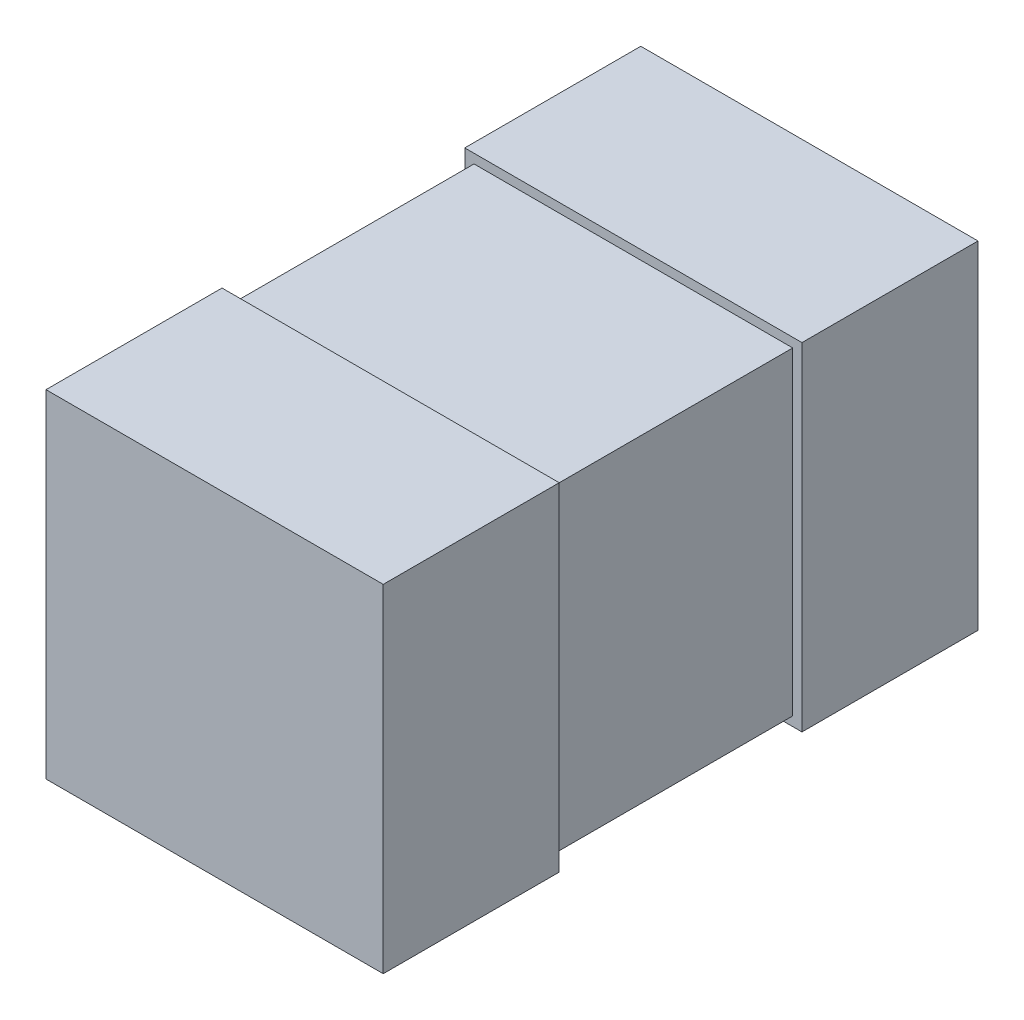
ISO-10303-21;
HEADER;
FILE_DESCRIPTION(('STEP AP214'),'2;1');
FILE_NAME('part.step','',(''),(''),'','','');
FILE_SCHEMA(('AUTOMOTIVE_DESIGN { 1 0 10303 214 1 1 1 1 }'));
ENDSEC;
DATA;
#1=APPLICATION_CONTEXT('core data for automotive mechanical design processes');
#2=APPLICATION_PROTOCOL_DEFINITION('international standard','automotive_design',2000,#1);
#3=PRODUCT_CONTEXT('',#1,'mechanical');
#4=PRODUCT('Part','Part','',(#3));
#5=PRODUCT_RELATED_PRODUCT_CATEGORY('part','',(#4));
#6=PRODUCT_DEFINITION_FORMATION('','',#4);
#7=PRODUCT_DEFINITION_CONTEXT('part definition',#1,'design');
#8=PRODUCT_DEFINITION('design','',#6,#7);
#9=PRODUCT_DEFINITION_SHAPE('','',#8);
#10=(LENGTH_UNIT() NAMED_UNIT(*) SI_UNIT(.MILLI.,.METRE.));
#11=(NAMED_UNIT(*) PLANE_ANGLE_UNIT() SI_UNIT($,.RADIAN.));
#12=(NAMED_UNIT(*) SI_UNIT($,.STERADIAN.) SOLID_ANGLE_UNIT());
#13=UNCERTAINTY_MEASURE_WITH_UNIT(LENGTH_MEASURE(1.E-05),#10,'distance_accuracy_value','');
#14=(GEOMETRIC_REPRESENTATION_CONTEXT(3) GLOBAL_UNCERTAINTY_ASSIGNED_CONTEXT((#13)) GLOBAL_UNIT_ASSIGNED_CONTEXT((#10,
#11,#12)) REPRESENTATION_CONTEXT('',''));
#15=CARTESIAN_POINT('',(0.,0.,0.));
#16=DIRECTION('',(0.,0.,1.));
#17=DIRECTION('',(1.,0.,0.));
#18=AXIS2_PLACEMENT_3D('',#15,#16,#17);
#19=CARTESIAN_POINT('',(-0.91,1.82,-1.605));
#20=DIRECTION('',(1.,0.,0.));
#21=DIRECTION('',(0.,1.,0.));
#22=AXIS2_PLACEMENT_3D('',#19,#20,#21);
#23=PLANE('',#22);
#24=DIRECTION('',(0.,1.,0.));
#25=VECTOR('',#24,1.);
#26=CARTESIAN_POINT('',(-0.91,1.82,-0.654999999999999));
#27=LINE('',#26,#25);
#28=CARTESIAN_POINT('',(-0.91,0.,-0.654999999999999));
#29=VERTEX_POINT('',#28);
#30=CARTESIAN_POINT('',(-0.91,1.82,-0.654999999999999));
#31=VERTEX_POINT('',#30);
#32=EDGE_CURVE('E106',#29,#31,#27,.T.);
#33=ORIENTED_EDGE('',*,*,#32,.T.);
#34=DIRECTION('',(0.,0.,1.));
#35=VECTOR('',#34,1.);
#36=CARTESIAN_POINT('',(-0.91,1.82,-1.605));
#37=LINE('',#36,#35);
#38=CARTESIAN_POINT('',(-0.91,1.82,-1.605));
#39=VERTEX_POINT('',#38);
#40=EDGE_CURVE('E12',#39,#31,#37,.T.);
#41=ORIENTED_EDGE('',*,*,#40,.F.);
#42=DIRECTION('',(0.,1.,0.));
#43=VECTOR('',#42,1.);
#44=CARTESIAN_POINT('',(-0.91,1.82,-1.605));
#45=LINE('',#44,#43);
#46=CARTESIAN_POINT('',(-0.91,0.,-1.605));
#47=VERTEX_POINT('',#46);
#48=EDGE_CURVE('E94',#47,#39,#45,.T.);
#49=ORIENTED_EDGE('',*,*,#48,.F.);
#50=DIRECTION('',(0.,0.,1.));
#51=VECTOR('',#50,1.);
#52=CARTESIAN_POINT('',(-0.91,0.,-1.605));
#53=LINE('',#52,#51);
#54=EDGE_CURVE('E102',#47,#29,#53,.T.);
#55=ORIENTED_EDGE('',*,*,#54,.T.);
#56=EDGE_LOOP('',(#33,#41,#49,#55));
#57=FACE_BOUND('',#56,.T.);
#58=ADVANCED_FACE('F43',(#57),#23,.F.);
#59=CARTESIAN_POINT('',(-0.91,1.82,-1.605));
#60=DIRECTION('',(0.,-1.,0.));
#61=DIRECTION('',(1.,0.,0.));
#62=AXIS2_PLACEMENT_3D('',#59,#60,#61);
#63=PLANE('',#62);
#64=DIRECTION('',(1.,0.,0.));
#65=VECTOR('',#64,1.);
#66=CARTESIAN_POINT('',(-0.91,1.82,-0.654999999999999));
#67=LINE('',#66,#65);
#68=CARTESIAN_POINT('',(0.91,1.82,-0.654999999999999));
#69=VERTEX_POINT('',#68);
#70=EDGE_CURVE('E98',#31,#69,#67,.T.);
#71=ORIENTED_EDGE('',*,*,#70,.T.);
#72=DIRECTION('',(0.,0.,1.));
#73=VECTOR('',#72,1.);
#74=CARTESIAN_POINT('',(0.91,1.82,-1.605));
#75=LINE('',#74,#73);
#76=CARTESIAN_POINT('',(0.91,1.82,-1.605));
#77=VERTEX_POINT('',#76);
#78=EDGE_CURVE('E51',#77,#69,#75,.T.);
#79=ORIENTED_EDGE('',*,*,#78,.F.);
#80=DIRECTION('',(1.,0.,0.));
#81=VECTOR('',#80,1.);
#82=CARTESIAN_POINT('',(-0.91,1.82,-1.605));
#83=LINE('',#82,#81);
#84=EDGE_CURVE('E89',#39,#77,#83,.T.);
#85=ORIENTED_EDGE('',*,*,#84,.F.);
#86=ORIENTED_EDGE('',*,*,#40,.T.);
#87=EDGE_LOOP('',(#71,#79,#85,#86));
#88=FACE_BOUND('',#87,.T.);
#89=ADVANCED_FACE('F97',(#88),#63,.F.);
#90=CARTESIAN_POINT('',(0.91,1.82,-1.605));
#91=DIRECTION('',(-1.,0.,0.));
#92=DIRECTION('',(0.,0.,1.));
#93=AXIS2_PLACEMENT_3D('',#90,#91,#92);
#94=PLANE('',#93);
#95=DIRECTION('',(0.,-1.,0.));
#96=VECTOR('',#95,1.);
#97=CARTESIAN_POINT('',(0.91,1.82,-0.654999999999999));
#98=LINE('',#97,#96);
#99=CARTESIAN_POINT('',(0.91,0.,-0.654999999999999));
#100=VERTEX_POINT('',#99);
#101=EDGE_CURVE('E76',#69,#100,#98,.T.);
#102=ORIENTED_EDGE('',*,*,#101,.T.);
#103=DIRECTION('',(0.,0.,1.));
#104=VECTOR('',#103,1.);
#105=CARTESIAN_POINT('',(0.91,0.,-1.605));
#106=LINE('',#105,#104);
#107=CARTESIAN_POINT('',(0.91,0.,-1.605));
#108=VERTEX_POINT('',#107);
#109=EDGE_CURVE('E99',#108,#100,#106,.T.);
#110=ORIENTED_EDGE('',*,*,#109,.F.);
#111=DIRECTION('',(0.,-1.,0.));
#112=VECTOR('',#111,1.);
#113=CARTESIAN_POINT('',(0.91,1.82,-1.605));
#114=LINE('',#113,#112);
#115=EDGE_CURVE('E92',#77,#108,#114,.T.);
#116=ORIENTED_EDGE('',*,*,#115,.F.);
#117=ORIENTED_EDGE('',*,*,#78,.T.);
#118=EDGE_LOOP('',(#102,#110,#116,#117));
#119=FACE_BOUND('',#118,.T.);
#120=ADVANCED_FACE('F100',(#119),#94,.F.);
#121=CARTESIAN_POINT('',(-0.91,0.,-1.605));
#122=DIRECTION('',(0.,1.,0.));
#123=DIRECTION('',(-1.,0.,0.));
#124=AXIS2_PLACEMENT_3D('',#121,#122,#123);
#125=PLANE('',#124);
#126=DIRECTION('',(-1.,0.,0.));
#127=VECTOR('',#126,1.);
#128=CARTESIAN_POINT('',(-0.91,0.,-0.654999999999999));
#129=LINE('',#128,#127);
#130=EDGE_CURVE('E82',#100,#29,#129,.T.);
#131=ORIENTED_EDGE('',*,*,#130,.T.);
#132=ORIENTED_EDGE('',*,*,#54,.F.);
#133=DIRECTION('',(-1.,0.,0.));
#134=VECTOR('',#133,1.);
#135=CARTESIAN_POINT('',(-0.91,0.,-1.605));
#136=LINE('',#135,#134);
#137=EDGE_CURVE('E59',#108,#47,#136,.T.);
#138=ORIENTED_EDGE('',*,*,#137,.F.);
#139=ORIENTED_EDGE('',*,*,#109,.T.);
#140=EDGE_LOOP('',(#131,#132,#138,#139));
#141=FACE_BOUND('',#140,.T.);
#142=ADVANCED_FACE('F113',(#141),#125,.F.);
#143=CARTESIAN_POINT('',(-0.91,0.,-1.605));
#144=DIRECTION('',(0.,0.,1.));
#145=DIRECTION('',(1.,0.,0.));
#146=AXIS2_PLACEMENT_3D('',#143,#144,#145);
#147=PLANE('',#146);
#148=ORIENTED_EDGE('',*,*,#48,.T.);
#149=ORIENTED_EDGE('',*,*,#84,.T.);
#150=ORIENTED_EDGE('',*,*,#115,.T.);
#151=ORIENTED_EDGE('',*,*,#137,.T.);
#152=EDGE_LOOP('',(#148,#149,#150,#151));
#153=FACE_BOUND('',#152,.T.);
#154=ADVANCED_FACE('F90',(#153),#147,.F.);
#155=CARTESIAN_POINT('',(-0.91,0.,-0.654999999999999));
#156=DIRECTION('',(0.,0.,1.));
#157=DIRECTION('',(1.,0.,0.));
#158=AXIS2_PLACEMENT_3D('',#155,#156,#157);
#159=PLANE('',#158);
#160=ORIENTED_EDGE('',*,*,#32,.F.);
#161=ORIENTED_EDGE('',*,*,#130,.F.);
#162=ORIENTED_EDGE('',*,*,#101,.F.);
#163=ORIENTED_EDGE('',*,*,#70,.F.);
#164=EDGE_LOOP('',(#160,#161,#162,#163));
#165=FACE_BOUND('',#164,.T.);
#166=ADVANCED_FACE('F116',(#165),#159,.T.);
#167=CLOSED_SHELL('',(#58,#89,#120,#142,#154,#166));
#168=MANIFOLD_SOLID_BREP('B2',#167);
#169=CARTESIAN_POINT('',(-0.86,0.0499999999999999,-0.654999999999999));
#170=DIRECTION('',(1.,0.,0.));
#171=DIRECTION('',(0.,0.,-1.));
#172=AXIS2_PLACEMENT_3D('',#169,#170,#171);
#173=PLANE('',#172);
#174=DIRECTION('',(0.,1.,0.));
#175=VECTOR('',#174,1.);
#176=CARTESIAN_POINT('',(-0.86,0.0499999999999999,0.655000000000001));
#177=LINE('',#176,#175);
#178=CARTESIAN_POINT('',(-0.86,0.0499999999999999,0.655000000000001));
#179=VERTEX_POINT('',#178);
#180=CARTESIAN_POINT('',(-0.86,1.77,0.655000000000001));
#181=VERTEX_POINT('',#180);
#182=EDGE_CURVE('E238',#179,#181,#177,.T.);
#183=ORIENTED_EDGE('',*,*,#182,.T.);
#184=DIRECTION('',(0.,0.,1.));
#185=VECTOR('',#184,1.);
#186=CARTESIAN_POINT('',(-0.86,1.77,-0.654999999999999));
#187=LINE('',#186,#185);
#188=CARTESIAN_POINT('',(-0.86,1.77,-0.654999999999999));
#189=VERTEX_POINT('',#188);
#190=EDGE_CURVE('E41',#189,#181,#187,.T.);
#191=ORIENTED_EDGE('',*,*,#190,.F.);
#192=DIRECTION('',(0.,1.,0.));
#193=VECTOR('',#192,1.);
#194=CARTESIAN_POINT('',(-0.86,0.0499999999999999,-0.654999999999999));
#195=LINE('',#194,#193);
#196=CARTESIAN_POINT('',(-0.86,0.0499999999999999,-0.654999999999999));
#197=VERTEX_POINT('',#196);
#198=EDGE_CURVE('E226',#197,#189,#195,.T.);
#199=ORIENTED_EDGE('',*,*,#198,.F.);
#200=DIRECTION('',(0.,0.,1.));
#201=VECTOR('',#200,1.);
#202=CARTESIAN_POINT('',(-0.86,0.0499999999999999,-0.654999999999999));
#203=LINE('',#202,#201);
#204=EDGE_CURVE('E234',#197,#179,#203,.T.);
#205=ORIENTED_EDGE('',*,*,#204,.T.);
#206=EDGE_LOOP('',(#183,#191,#199,#205));
#207=FACE_BOUND('',#206,.T.);
#208=ADVANCED_FACE('F175',(#207),#173,.F.);
#209=CARTESIAN_POINT('',(-0.86,1.77,-0.654999999999999));
#210=DIRECTION('',(0.,-1.,0.));
#211=DIRECTION('',(0.,0.,-1.));
#212=AXIS2_PLACEMENT_3D('',#209,#210,#211);
#213=PLANE('',#212);
#214=DIRECTION('',(1.,0.,0.));
#215=VECTOR('',#214,1.);
#216=CARTESIAN_POINT('',(-0.86,1.77,0.655000000000001));
#217=LINE('',#216,#215);
#218=CARTESIAN_POINT('',(0.86,1.77,0.655000000000001));
#219=VERTEX_POINT('',#218);
#220=EDGE_CURVE('E230',#181,#219,#217,.T.);
#221=ORIENTED_EDGE('',*,*,#220,.T.);
#222=DIRECTION('',(0.,0.,1.));
#223=VECTOR('',#222,1.);
#224=CARTESIAN_POINT('',(0.86,1.77,-0.654999999999999));
#225=LINE('',#224,#223);
#226=CARTESIAN_POINT('',(0.86,1.77,-0.654999999999999));
#227=VERTEX_POINT('',#226);
#228=EDGE_CURVE('E183',#227,#219,#225,.T.);
#229=ORIENTED_EDGE('',*,*,#228,.F.);
#230=DIRECTION('',(1.,0.,0.));
#231=VECTOR('',#230,1.);
#232=CARTESIAN_POINT('',(-0.86,1.77,-0.654999999999999));
#233=LINE('',#232,#231);
#234=EDGE_CURVE('E221',#189,#227,#233,.T.);
#235=ORIENTED_EDGE('',*,*,#234,.F.);
#236=ORIENTED_EDGE('',*,*,#190,.T.);
#237=EDGE_LOOP('',(#221,#229,#235,#236));
#238=FACE_BOUND('',#237,.T.);
#239=ADVANCED_FACE('F229',(#238),#213,.F.);
#240=CARTESIAN_POINT('',(0.86,0.0499999999999999,-0.654999999999999));
#241=DIRECTION('',(-1.,0.,0.));
#242=DIRECTION('',(0.,0.,1.));
#243=AXIS2_PLACEMENT_3D('',#240,#241,#242);
#244=PLANE('',#243);
#245=DIRECTION('',(0.,-1.,0.));
#246=VECTOR('',#245,1.);
#247=CARTESIAN_POINT('',(0.86,0.0499999999999999,0.655000000000001));
#248=LINE('',#247,#246);
#249=CARTESIAN_POINT('',(0.86,0.0499999999999999,0.655000000000001));
#250=VERTEX_POINT('',#249);
#251=EDGE_CURVE('E208',#219,#250,#248,.T.);
#252=ORIENTED_EDGE('',*,*,#251,.T.);
#253=DIRECTION('',(0.,0.,1.));
#254=VECTOR('',#253,1.);
#255=CARTESIAN_POINT('',(0.86,0.0499999999999999,-0.654999999999999));
#256=LINE('',#255,#254);
#257=CARTESIAN_POINT('',(0.86,0.0499999999999999,-0.654999999999999));
#258=VERTEX_POINT('',#257);
#259=EDGE_CURVE('E231',#258,#250,#256,.T.);
#260=ORIENTED_EDGE('',*,*,#259,.F.);
#261=DIRECTION('',(0.,-1.,0.));
#262=VECTOR('',#261,1.);
#263=CARTESIAN_POINT('',(0.86,0.0499999999999999,-0.654999999999999));
#264=LINE('',#263,#262);
#265=EDGE_CURVE('E224',#227,#258,#264,.T.);
#266=ORIENTED_EDGE('',*,*,#265,.F.);
#267=ORIENTED_EDGE('',*,*,#228,.T.);
#268=EDGE_LOOP('',(#252,#260,#266,#267));
#269=FACE_BOUND('',#268,.T.);
#270=ADVANCED_FACE('F232',(#269),#244,.F.);
#271=CARTESIAN_POINT('',(-0.86,0.0499999999999999,-0.654999999999999));
#272=DIRECTION('',(0.,1.,0.));
#273=DIRECTION('',(0.,0.,1.));
#274=AXIS2_PLACEMENT_3D('',#271,#272,#273);
#275=PLANE('',#274);
#276=DIRECTION('',(-1.,0.,0.));
#277=VECTOR('',#276,1.);
#278=CARTESIAN_POINT('',(-0.86,0.0499999999999999,0.655000000000001));
#279=LINE('',#278,#277);
#280=EDGE_CURVE('E214',#250,#179,#279,.T.);
#281=ORIENTED_EDGE('',*,*,#280,.T.);
#282=ORIENTED_EDGE('',*,*,#204,.F.);
#283=DIRECTION('',(-1.,0.,0.));
#284=VECTOR('',#283,1.);
#285=CARTESIAN_POINT('',(-0.86,0.0499999999999999,-0.654999999999999));
#286=LINE('',#285,#284);
#287=EDGE_CURVE('E191',#258,#197,#286,.T.);
#288=ORIENTED_EDGE('',*,*,#287,.F.);
#289=ORIENTED_EDGE('',*,*,#259,.T.);
#290=EDGE_LOOP('',(#281,#282,#288,#289));
#291=FACE_BOUND('',#290,.T.);
#292=ADVANCED_FACE('F245',(#291),#275,.F.);
#293=CARTESIAN_POINT('',(-0.86,1.77,-0.654999999999999));
#294=DIRECTION('',(0.,0.,-1.));
#295=DIRECTION('',(-1.,0.,0.));
#296=AXIS2_PLACEMENT_3D('',#293,#294,#295);
#297=PLANE('',#296);
#298=ORIENTED_EDGE('',*,*,#198,.T.);
#299=ORIENTED_EDGE('',*,*,#234,.T.);
#300=ORIENTED_EDGE('',*,*,#265,.T.);
#301=ORIENTED_EDGE('',*,*,#287,.T.);
#302=EDGE_LOOP('',(#298,#299,#300,#301));
#303=FACE_BOUND('',#302,.T.);
#304=ADVANCED_FACE('F222',(#303),#297,.T.);
#305=CARTESIAN_POINT('',(-0.86,1.77,0.655000000000001));
#306=DIRECTION('',(0.,0.,-1.));
#307=DIRECTION('',(-1.,0.,0.));
#308=AXIS2_PLACEMENT_3D('',#305,#306,#307);
#309=PLANE('',#308);
#310=ORIENTED_EDGE('',*,*,#182,.F.);
#311=ORIENTED_EDGE('',*,*,#280,.F.);
#312=ORIENTED_EDGE('',*,*,#251,.F.);
#313=ORIENTED_EDGE('',*,*,#220,.F.);
#314=EDGE_LOOP('',(#310,#311,#312,#313));
#315=FACE_BOUND('',#314,.T.);
#316=ADVANCED_FACE('F248',(#315),#309,.F.);
#317=CLOSED_SHELL('',(#208,#239,#270,#292,#304,#316));
#318=MANIFOLD_SOLID_BREP('B6',#317);
#319=CARTESIAN_POINT('',(-0.91,1.82,1.605));
#320=DIRECTION('',(1.,0.,0.));
#321=DIRECTION('',(0.,0.,-1.));
#322=AXIS2_PLACEMENT_3D('',#319,#320,#321);
#323=PLANE('',#322);
#324=DIRECTION('',(0.,0.,1.));
#325=VECTOR('',#324,1.);
#326=CARTESIAN_POINT('',(-0.91,0.,1.605));
#327=LINE('',#326,#325);
#328=CARTESIAN_POINT('',(-0.91,0.,0.655000000000001));
#329=VERTEX_POINT('',#328);
#330=CARTESIAN_POINT('',(-0.91,0.,1.605));
#331=VERTEX_POINT('',#330);
#332=EDGE_CURVE('E361',#329,#331,#327,.T.);
#333=ORIENTED_EDGE('',*,*,#332,.T.);
#334=DIRECTION('',(0.,-1.,0.));
#335=VECTOR('',#334,1.);
#336=CARTESIAN_POINT('',(-0.91,1.82,1.605));
#337=LINE('',#336,#335);
#338=CARTESIAN_POINT('',(-0.91,1.82,1.605));
#339=VERTEX_POINT('',#338);
#340=EDGE_CURVE('E173',#339,#331,#337,.T.);
#341=ORIENTED_EDGE('',*,*,#340,.F.);
#342=DIRECTION('',(0.,0.,1.));
#343=VECTOR('',#342,1.);
#344=CARTESIAN_POINT('',(-0.91,1.82,1.605));
#345=LINE('',#344,#343);
#346=CARTESIAN_POINT('',(-0.91,1.82,0.655000000000001));
#347=VERTEX_POINT('',#346);
#348=EDGE_CURVE('E349',#347,#339,#345,.T.);
#349=ORIENTED_EDGE('',*,*,#348,.F.);
#350=DIRECTION('',(0.,-1.,0.));
#351=VECTOR('',#350,1.);
#352=CARTESIAN_POINT('',(-0.91,1.82,0.655000000000001));
#353=LINE('',#352,#351);
#354=EDGE_CURVE('E357',#347,#329,#353,.T.);
#355=ORIENTED_EDGE('',*,*,#354,.T.);
#356=EDGE_LOOP('',(#333,#341,#349,#355));
#357=FACE_BOUND('',#356,.T.);
#358=ADVANCED_FACE('F298',(#357),#323,.F.);
#359=CARTESIAN_POINT('',(-0.91,1.82,1.605));
#360=DIRECTION('',(0.,0.,-1.));
#361=DIRECTION('',(-1.,0.,0.));
#362=AXIS2_PLACEMENT_3D('',#359,#360,#361);
#363=PLANE('',#362);
#364=DIRECTION('',(1.,0.,0.));
#365=VECTOR('',#364,1.);
#366=CARTESIAN_POINT('',(-0.91,0.,1.605));
#367=LINE('',#366,#365);
#368=CARTESIAN_POINT('',(0.91,0.,1.605));
#369=VERTEX_POINT('',#368);
#370=EDGE_CURVE('E353',#331,#369,#367,.T.);
#371=ORIENTED_EDGE('',*,*,#370,.T.);
#372=DIRECTION('',(0.,-1.,0.));
#373=VECTOR('',#372,1.);
#374=CARTESIAN_POINT('',(0.91,1.82,1.605));
#375=LINE('',#374,#373);
#376=CARTESIAN_POINT('',(0.91,1.82,1.605));
#377=VERTEX_POINT('',#376);
#378=EDGE_CURVE('E306',#377,#369,#375,.T.);
#379=ORIENTED_EDGE('',*,*,#378,.F.);
#380=DIRECTION('',(1.,0.,0.));
#381=VECTOR('',#380,1.);
#382=CARTESIAN_POINT('',(-0.91,1.82,1.605));
#383=LINE('',#382,#381);
#384=EDGE_CURVE('E344',#339,#377,#383,.T.);
#385=ORIENTED_EDGE('',*,*,#384,.F.);
#386=ORIENTED_EDGE('',*,*,#340,.T.);
#387=EDGE_LOOP('',(#371,#379,#385,#386));
#388=FACE_BOUND('',#387,.T.);
#389=ADVANCED_FACE('F352',(#388),#363,.F.);
#390=CARTESIAN_POINT('',(0.91,1.82,1.605));
#391=DIRECTION('',(-1.,0.,0.));
#392=DIRECTION('',(0.,0.,1.));
#393=AXIS2_PLACEMENT_3D('',#390,#391,#392);
#394=PLANE('',#393);
#395=DIRECTION('',(0.,0.,-1.));
#396=VECTOR('',#395,1.);
#397=CARTESIAN_POINT('',(0.91,0.,1.605));
#398=LINE('',#397,#396);
#399=CARTESIAN_POINT('',(0.91,0.,0.655000000000001));
#400=VERTEX_POINT('',#399);
#401=EDGE_CURVE('E331',#369,#400,#398,.T.);
#402=ORIENTED_EDGE('',*,*,#401,.T.);
#403=DIRECTION('',(0.,-1.,0.));
#404=VECTOR('',#403,1.);
#405=CARTESIAN_POINT('',(0.91,1.82,0.655000000000001));
#406=LINE('',#405,#404);
#407=CARTESIAN_POINT('',(0.91,1.82,0.655000000000001));
#408=VERTEX_POINT('',#407);
#409=EDGE_CURVE('E354',#408,#400,#406,.T.);
#410=ORIENTED_EDGE('',*,*,#409,.F.);
#411=DIRECTION('',(0.,0.,-1.));
#412=VECTOR('',#411,1.);
#413=CARTESIAN_POINT('',(0.91,1.82,1.605));
#414=LINE('',#413,#412);
#415=EDGE_CURVE('E347',#377,#408,#414,.T.);
#416=ORIENTED_EDGE('',*,*,#415,.F.);
#417=ORIENTED_EDGE('',*,*,#378,.T.);
#418=EDGE_LOOP('',(#402,#410,#416,#417));
#419=FACE_BOUND('',#418,.T.);
#420=ADVANCED_FACE('F355',(#419),#394,.F.);
#421=CARTESIAN_POINT('',(-0.91,1.82,0.655000000000001));
#422=DIRECTION('',(0.,0.,1.));
#423=DIRECTION('',(1.,0.,0.));
#424=AXIS2_PLACEMENT_3D('',#421,#422,#423);
#425=PLANE('',#424);
#426=DIRECTION('',(-1.,0.,0.));
#427=VECTOR('',#426,1.);
#428=CARTESIAN_POINT('',(-0.91,0.,0.655000000000001));
#429=LINE('',#428,#427);
#430=EDGE_CURVE('E337',#400,#329,#429,.T.);
#431=ORIENTED_EDGE('',*,*,#430,.T.);
#432=ORIENTED_EDGE('',*,*,#354,.F.);
#433=DIRECTION('',(-1.,0.,0.));
#434=VECTOR('',#433,1.);
#435=CARTESIAN_POINT('',(-0.91,1.82,0.655000000000001));
#436=LINE('',#435,#434);
#437=EDGE_CURVE('E314',#408,#347,#436,.T.);
#438=ORIENTED_EDGE('',*,*,#437,.F.);
#439=ORIENTED_EDGE('',*,*,#409,.T.);
#440=EDGE_LOOP('',(#431,#432,#438,#439));
#441=FACE_BOUND('',#440,.T.);
#442=ADVANCED_FACE('F368',(#441),#425,.F.);
#443=CARTESIAN_POINT('',(-0.91,1.82,0.655000000000001));
#444=DIRECTION('',(0.,-1.,0.));
#445=DIRECTION('',(0.,0.,-1.));
#446=AXIS2_PLACEMENT_3D('',#443,#444,#445);
#447=PLANE('',#446);
#448=ORIENTED_EDGE('',*,*,#348,.T.);
#449=ORIENTED_EDGE('',*,*,#384,.T.);
#450=ORIENTED_EDGE('',*,*,#415,.T.);
#451=ORIENTED_EDGE('',*,*,#437,.T.);
#452=EDGE_LOOP('',(#448,#449,#450,#451));
#453=FACE_BOUND('',#452,.T.);
#454=ADVANCED_FACE('F345',(#453),#447,.F.);
#455=CARTESIAN_POINT('',(-0.91,0.,0.655000000000001));
#456=DIRECTION('',(0.,-1.,0.));
#457=DIRECTION('',(0.,0.,-1.));
#458=AXIS2_PLACEMENT_3D('',#455,#456,#457);
#459=PLANE('',#458);
#460=ORIENTED_EDGE('',*,*,#332,.F.);
#461=ORIENTED_EDGE('',*,*,#430,.F.);
#462=ORIENTED_EDGE('',*,*,#401,.F.);
#463=ORIENTED_EDGE('',*,*,#370,.F.);
#464=EDGE_LOOP('',(#460,#461,#462,#463));
#465=FACE_BOUND('',#464,.T.);
#466=ADVANCED_FACE('F371',(#465),#459,.T.);
#467=CLOSED_SHELL('',(#358,#389,#420,#442,#454,#466));
#468=MANIFOLD_SOLID_BREP('B35',#467);
#469=ADVANCED_BREP_SHAPE_REPRESENTATION('',(#18,#168,#318,#468),#14);
#470=SHAPE_DEFINITION_REPRESENTATION(#9,#469);
ENDSEC;
END-ISO-10303-21;
